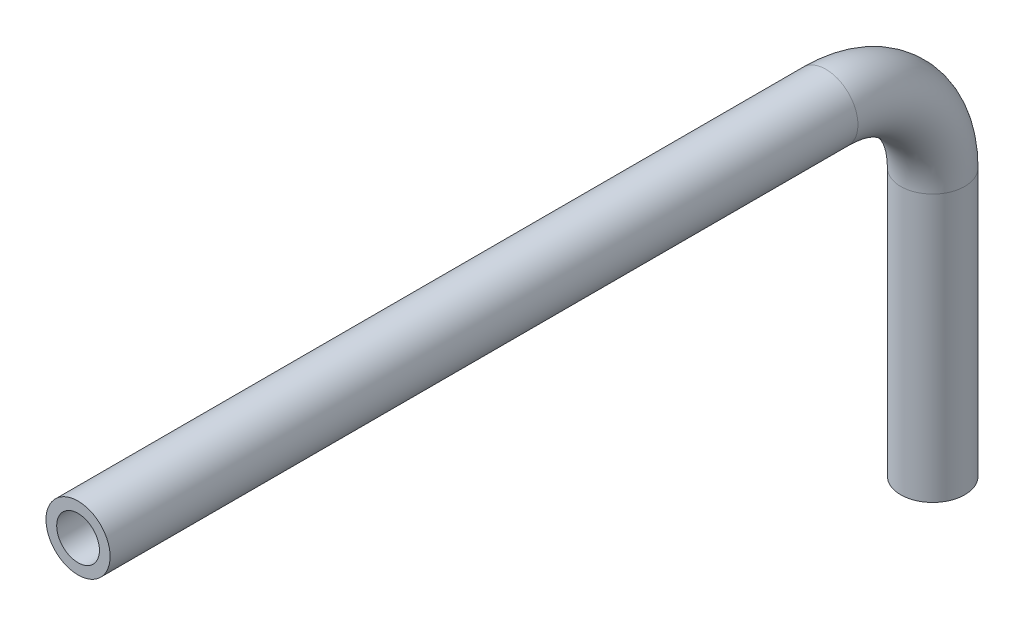
ISO-10303-21;
HEADER;
FILE_DESCRIPTION(('STEP AP214'),'2;1');
FILE_NAME('part.step','',(''),(''),'','','');
FILE_SCHEMA(('AUTOMOTIVE_DESIGN { 1 0 10303 214 1 1 1 1 }'));
ENDSEC;
DATA;
#1=APPLICATION_CONTEXT('core data for automotive mechanical design processes');
#2=APPLICATION_PROTOCOL_DEFINITION('international standard','automotive_design',2000,#1);
#3=PRODUCT_CONTEXT('',#1,'mechanical');
#4=PRODUCT('Part','Part','',(#3));
#5=PRODUCT_RELATED_PRODUCT_CATEGORY('part','',(#4));
#6=PRODUCT_DEFINITION_FORMATION('','',#4);
#7=PRODUCT_DEFINITION_CONTEXT('part definition',#1,'design');
#8=PRODUCT_DEFINITION('design','',#6,#7);
#9=PRODUCT_DEFINITION_SHAPE('','',#8);
#10=(LENGTH_UNIT() NAMED_UNIT(*) SI_UNIT(.MILLI.,.METRE.));
#11=(NAMED_UNIT(*) PLANE_ANGLE_UNIT() SI_UNIT($,.RADIAN.));
#12=(NAMED_UNIT(*) SI_UNIT($,.STERADIAN.) SOLID_ANGLE_UNIT());
#13=UNCERTAINTY_MEASURE_WITH_UNIT(LENGTH_MEASURE(1.E-05),#10,'distance_accuracy_value','');
#14=(GEOMETRIC_REPRESENTATION_CONTEXT(3) GLOBAL_UNCERTAINTY_ASSIGNED_CONTEXT((#13)) GLOBAL_UNIT_ASSIGNED_CONTEXT((#10,
#11,#12)) REPRESENTATION_CONTEXT('',''));
#15=CARTESIAN_POINT('',(0.,0.,0.));
#16=DIRECTION('',(0.,0.,1.));
#17=DIRECTION('',(1.,0.,0.));
#18=AXIS2_PLACEMENT_3D('',#15,#16,#17);
#19=CARTESIAN_POINT('',(0.,0.,0.));
#20=DIRECTION('',(0.,0.,1.));
#21=DIRECTION('',(0.,-1.,0.));
#22=AXIS2_PLACEMENT_3D('',#19,#20,#21);
#23=PLANE('',#22);
#24=CARTESIAN_POINT('',(0.,0.,0.));
#25=DIRECTION('',(0.,0.,1.));
#26=DIRECTION('',(0.,-1.,0.));
#27=AXIS2_PLACEMENT_3D('',#24,#25,#26);
#28=CIRCLE('',#27,20.);
#29=CARTESIAN_POINT('',(0.,-20.,0.));
#30=VERTEX_POINT('',#29);
#31=EDGE_CURVE('E66',#30,#30,#28,.T.);
#32=ORIENTED_EDGE('',*,*,#31,.F.);
#33=EDGE_LOOP('',(#32));
#34=FACE_BOUND('',#33,.T.);
#35=CARTESIAN_POINT('',(0.,0.,0.));
#36=DIRECTION('',(0.,0.,1.));
#37=DIRECTION('',(0.,-1.,0.));
#38=AXIS2_PLACEMENT_3D('',#35,#36,#37);
#39=CIRCLE('',#38,30.);
#40=CARTESIAN_POINT('',(0.,-30.,0.));
#41=VERTEX_POINT('',#40);
#42=EDGE_CURVE('E57',#41,#41,#39,.T.);
#43=ORIENTED_EDGE('',*,*,#42,.T.);
#44=EDGE_LOOP('',(#43));
#45=FACE_BOUND('',#44,.T.);
#46=ADVANCED_FACE('F43',(#34,#45),#23,.T.);
#47=CARTESIAN_POINT('',(0.,-350.,-800.));
#48=DIRECTION('',(0.,1.,0.));
#49=DIRECTION('',(0.,0.,1.));
#50=AXIS2_PLACEMENT_3D('',#47,#48,#49);
#51=PLANE('',#50);
#52=CARTESIAN_POINT('',(0.,-350.,-800.));
#53=DIRECTION('',(0.,1.,0.));
#54=DIRECTION('',(0.,0.,1.));
#55=AXIS2_PLACEMENT_3D('',#52,#53,#54);
#56=CIRCLE('',#55,20.);
#57=CARTESIAN_POINT('',(0.,-350.,-780.));
#58=VERTEX_POINT('',#57);
#59=EDGE_CURVE('E62',#58,#58,#56,.T.);
#60=ORIENTED_EDGE('',*,*,#59,.T.);
#61=EDGE_LOOP('',(#60));
#62=FACE_BOUND('',#61,.T.);
#63=CARTESIAN_POINT('',(0.,-350.,-800.));
#64=DIRECTION('',(0.,1.,0.));
#65=DIRECTION('',(0.,0.,1.));
#66=AXIS2_PLACEMENT_3D('',#63,#64,#65);
#67=CIRCLE('',#66,30.);
#68=CARTESIAN_POINT('',(0.,-350.,-770.));
#69=VERTEX_POINT('',#68);
#70=EDGE_CURVE('E11',#69,#69,#67,.T.);
#71=ORIENTED_EDGE('',*,*,#70,.F.);
#72=EDGE_LOOP('',(#71));
#73=FACE_BOUND('',#72,.T.);
#74=ADVANCED_FACE('F86',(#62,#73),#51,.F.);
#75=CARTESIAN_POINT('',(0.,0.,0.));
#76=DIRECTION('',(0.,0.,-1.));
#77=DIRECTION('',(-1.,0.,0.));
#78=AXIS2_PLACEMENT_3D('',#75,#76,#77);
#79=CYLINDRICAL_SURFACE('',#78,30.);
#80=CARTESIAN_POINT('',(0.,0.,-699.999999999999));
#81=DIRECTION('',(0.,0.,1.));
#82=DIRECTION('',(0.,-1.,0.));
#83=AXIS2_PLACEMENT_3D('',#80,#81,#82);
#84=CIRCLE('',#83,30.);
#85=CARTESIAN_POINT('',(0.,30.,-699.999999999999));
#86=VERTEX_POINT('',#85);
#87=EDGE_CURVE('E53',#86,#86,#84,.T.);
#88=ORIENTED_EDGE('',*,*,#87,.T.);
#89=EDGE_LOOP('',(#88));
#90=FACE_BOUND('',#89,.T.);
#91=ORIENTED_EDGE('',*,*,#42,.F.);
#92=EDGE_LOOP('',(#91));
#93=FACE_BOUND('',#92,.T.);
#94=ADVANCED_FACE('F90',(#90,#93),#79,.T.);
#95=CARTESIAN_POINT('',(0.,-100.,-700.));
#96=DIRECTION('',(-1.,0.,0.));
#97=DIRECTION('',(0.,0.,1.));
#98=AXIS2_PLACEMENT_3D('',#95,#96,#97);
#99=TOROIDAL_SURFACE('',#98,100.,30.);
#100=CARTESIAN_POINT('',(0.,-99.9999999999953,-800.000000000002));
#101=DIRECTION('',(0.,1.,0.));
#102=DIRECTION('',(0.,0.,1.));
#103=AXIS2_PLACEMENT_3D('',#100,#101,#102);
#104=CIRCLE('',#103,30.);
#105=CARTESIAN_POINT('',(0.,-99.9999999999939,-830.));
#106=VERTEX_POINT('',#105);
#107=EDGE_CURVE('E49',#106,#106,#104,.T.);
#108=CARTESIAN_POINT('',(0.,-100.,-700.));
#109=DIRECTION('',(-1.,0.,0.));
#110=DIRECTION('',(0.,0.,1.));
#111=AXIS2_PLACEMENT_3D('',#108,#109,#110);
#112=CIRCLE('',#111,130.);
#113=EDGE_CURVE('',#86,#106,#112,.T.);
#114=ORIENTED_EDGE('',*,*,#87,.F.);
#115=ORIENTED_EDGE('',*,*,#107,.T.);
#116=ORIENTED_EDGE('',*,*,#113,.T.);
#117=ORIENTED_EDGE('',*,*,#113,.F.);
#118=EDGE_LOOP('',(#114,#116,#115,#117));
#119=FACE_BOUND('',#118,.T.);
#120=ADVANCED_FACE('F92',(#119),#99,.T.);
#121=CARTESIAN_POINT('',(0.,-100.000000000001,-800.));
#122=DIRECTION('',(0.,-1.,0.));
#123=DIRECTION('',(0.,0.,-1.));
#124=AXIS2_PLACEMENT_3D('',#121,#122,#123);
#125=CYLINDRICAL_SURFACE('',#124,30.);
#126=ORIENTED_EDGE('',*,*,#70,.T.);
#127=EDGE_LOOP('',(#126));
#128=FACE_BOUND('',#127,.T.);
#129=ORIENTED_EDGE('',*,*,#107,.F.);
#130=EDGE_LOOP('',(#129));
#131=FACE_BOUND('',#130,.T.);
#132=ADVANCED_FACE('F80',(#128,#131),#125,.T.);
#133=CARTESIAN_POINT('',(0.,0.,0.));
#134=DIRECTION('',(0.,0.,-1.));
#135=DIRECTION('',(-1.,0.,0.));
#136=AXIS2_PLACEMENT_3D('',#133,#134,#135);
#137=CYLINDRICAL_SURFACE('',#136,20.);
#138=CARTESIAN_POINT('',(0.,0.,-699.999999999999));
#139=DIRECTION('',(0.,0.,-1.));
#140=DIRECTION('',(-1.,0.,0.));
#141=AXIS2_PLACEMENT_3D('',#138,#139,#140);
#142=CIRCLE('',#141,20.);
#143=CARTESIAN_POINT('',(0.,20.,-699.999999999999));
#144=VERTEX_POINT('',#143);
#145=EDGE_CURVE('E69',#144,#144,#142,.F.);
#146=ORIENTED_EDGE('',*,*,#145,.F.);
#147=EDGE_LOOP('',(#146));
#148=FACE_BOUND('',#147,.T.);
#149=ORIENTED_EDGE('',*,*,#31,.T.);
#150=EDGE_LOOP('',(#149));
#151=FACE_BOUND('',#150,.T.);
#152=ADVANCED_FACE('F77',(#148,#151),#137,.F.);
#153=CARTESIAN_POINT('',(0.,-100.,-700.));
#154=DIRECTION('',(-1.,0.,0.));
#155=DIRECTION('',(0.,0.,1.));
#156=AXIS2_PLACEMENT_3D('',#153,#154,#155);
#157=TOROIDAL_SURFACE('',#156,100.,20.);
#158=CARTESIAN_POINT('',(0.,-99.9999999999964,-800.));
#159=DIRECTION('',(0.,1.,0.));
#160=DIRECTION('',(0.,0.,1.));
#161=AXIS2_PLACEMENT_3D('',#158,#159,#160);
#162=CIRCLE('',#161,20.);
#163=CARTESIAN_POINT('',(0.,-99.9999999999957,-820.));
#164=VERTEX_POINT('',#163);
#165=EDGE_CURVE('E65',#164,#164,#162,.T.);
#166=CARTESIAN_POINT('',(0.,-100.,-700.));
#167=DIRECTION('',(-1.,0.,0.));
#168=DIRECTION('',(0.,0.,1.));
#169=AXIS2_PLACEMENT_3D('',#166,#167,#168);
#170=CIRCLE('',#169,120.);
#171=EDGE_CURVE('',#144,#164,#170,.T.);
#172=ORIENTED_EDGE('',*,*,#145,.T.);
#173=ORIENTED_EDGE('',*,*,#165,.F.);
#174=ORIENTED_EDGE('',*,*,#171,.T.);
#175=ORIENTED_EDGE('',*,*,#171,.F.);
#176=EDGE_LOOP('',(#172,#174,#173,#175));
#177=FACE_BOUND('',#176,.T.);
#178=ADVANCED_FACE('F75',(#177),#157,.F.);
#179=CARTESIAN_POINT('',(0.,-100.000000000001,-800.));
#180=DIRECTION('',(0.,-1.,0.));
#181=DIRECTION('',(0.,0.,-1.));
#182=AXIS2_PLACEMENT_3D('',#179,#180,#181);
#183=CYLINDRICAL_SURFACE('',#182,20.);
#184=ORIENTED_EDGE('',*,*,#59,.F.);
#185=EDGE_LOOP('',(#184));
#186=FACE_BOUND('',#185,.T.);
#187=ORIENTED_EDGE('',*,*,#165,.T.);
#188=EDGE_LOOP('',(#187));
#189=FACE_BOUND('',#188,.T.);
#190=ADVANCED_FACE('F87',(#186,#189),#183,.F.);
#191=CLOSED_SHELL('',(#46,#74,#94,#120,#132,#152,#178,#190));
#192=MANIFOLD_SOLID_BREP('B2',#191);
#193=ADVANCED_BREP_SHAPE_REPRESENTATION('',(#18,#192),#14);
#194=SHAPE_DEFINITION_REPRESENTATION(#9,#193);
ENDSEC;
END-ISO-10303-21;
